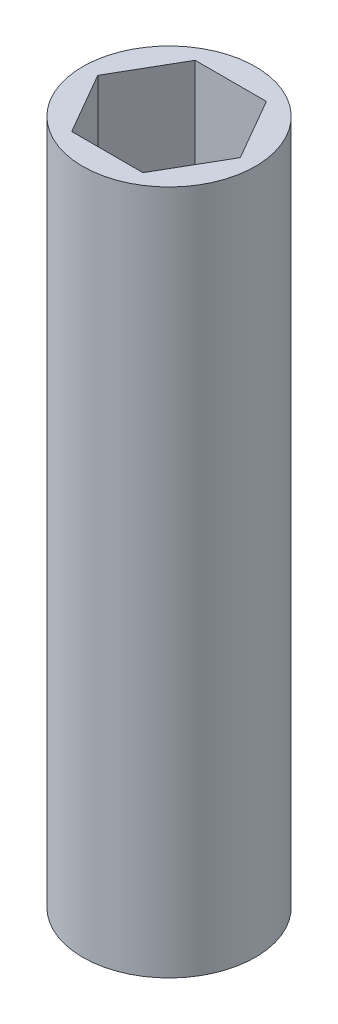
ISO-10303-21;
HEADER;
FILE_DESCRIPTION(('STEP AP214'),'2;1');
FILE_NAME('part.step','',(''),(''),'','','');
FILE_SCHEMA(('AUTOMOTIVE_DESIGN { 1 0 10303 214 1 1 1 1 }'));
ENDSEC;
DATA;
#1=APPLICATION_CONTEXT('core data for automotive mechanical design processes');
#2=APPLICATION_PROTOCOL_DEFINITION('international standard','automotive_design',2000,#1);
#3=PRODUCT_CONTEXT('',#1,'mechanical');
#4=PRODUCT('Part','Part','',(#3));
#5=PRODUCT_RELATED_PRODUCT_CATEGORY('part','',(#4));
#6=PRODUCT_DEFINITION_FORMATION('','',#4);
#7=PRODUCT_DEFINITION_CONTEXT('part definition',#1,'design');
#8=PRODUCT_DEFINITION('design','',#6,#7);
#9=PRODUCT_DEFINITION_SHAPE('','',#8);
#10=(LENGTH_UNIT() NAMED_UNIT(*) SI_UNIT(.MILLI.,.METRE.));
#11=(NAMED_UNIT(*) PLANE_ANGLE_UNIT() SI_UNIT($,.RADIAN.));
#12=(NAMED_UNIT(*) SI_UNIT($,.STERADIAN.) SOLID_ANGLE_UNIT());
#13=UNCERTAINTY_MEASURE_WITH_UNIT(LENGTH_MEASURE(1.E-05),#10,'distance_accuracy_value','');
#14=(GEOMETRIC_REPRESENTATION_CONTEXT(3) GLOBAL_UNCERTAINTY_ASSIGNED_CONTEXT((#13)) GLOBAL_UNIT_ASSIGNED_CONTEXT((#10,
#11,#12)) REPRESENTATION_CONTEXT('',''));
#15=CARTESIAN_POINT('',(0.,0.,0.));
#16=DIRECTION('',(0.,0.,1.));
#17=DIRECTION('',(1.,0.,0.));
#18=AXIS2_PLACEMENT_3D('',#15,#16,#17);
#19=CARTESIAN_POINT('',(0.,56.388,0.));
#20=DIRECTION('',(0.,1.,0.));
#21=DIRECTION('',(0.,0.,1.));
#22=AXIS2_PLACEMENT_3D('',#19,#20,#21);
#23=PLANE('',#22);
#24=CARTESIAN_POINT('',(0.,56.388,0.));
#25=DIRECTION('',(0.,1.,0.));
#26=DIRECTION('',(0.,0.,1.));
#27=AXIS2_PLACEMENT_3D('',#24,#25,#26);
#28=CIRCLE('',#27,7.112);
#29=CARTESIAN_POINT('',(0.,56.388,7.112));
#30=VERTEX_POINT('',#29);
#31=EDGE_CURVE('E11',#30,#30,#28,.T.);
#32=ORIENTED_EDGE('',*,*,#31,.T.);
#33=EDGE_LOOP('',(#32));
#34=FACE_BOUND('',#33,.T.);
#35=DIRECTION('',(0.5,0.,-0.866025403784439));
#36=VECTOR('',#35,1.);
#37=CARTESIAN_POINT('',(2.9329393674833,56.388,5.08));
#38=LINE('',#37,#36);
#39=CARTESIAN_POINT('',(2.9329393674833,56.388,5.08));
#40=VERTEX_POINT('',#39);
#41=CARTESIAN_POINT('',(5.8658787349666,56.388,0.));
#42=VERTEX_POINT('',#41);
#43=EDGE_CURVE('E103',#40,#42,#38,.T.);
#44=ORIENTED_EDGE('',*,*,#43,.F.);
#45=DIRECTION('',(1.,0.,0.));
#46=VECTOR('',#45,1.);
#47=CARTESIAN_POINT('',(-2.9329393674833,56.388,5.08));
#48=LINE('',#47,#46);
#49=CARTESIAN_POINT('',(-2.9329393674833,56.388,5.08));
#50=VERTEX_POINT('',#49);
#51=EDGE_CURVE('E95',#50,#40,#48,.T.);
#52=ORIENTED_EDGE('',*,*,#51,.F.);
#53=DIRECTION('',(0.5,0.,0.866025403784439));
#54=VECTOR('',#53,1.);
#55=CARTESIAN_POINT('',(-5.8658787349666,56.388,0.));
#56=LINE('',#55,#54);
#57=CARTESIAN_POINT('',(-5.8658787349666,56.388,0.));
#58=VERTEX_POINT('',#57);
#59=EDGE_CURVE('E123',#58,#50,#56,.T.);
#60=ORIENTED_EDGE('',*,*,#59,.F.);
#61=DIRECTION('',(-0.5,0.,0.866025403784439));
#62=VECTOR('',#61,1.);
#63=CARTESIAN_POINT('',(-2.9329393674833,56.388,-5.08));
#64=LINE('',#63,#62);
#65=CARTESIAN_POINT('',(-2.9329393674833,56.388,-5.08));
#66=VERTEX_POINT('',#65);
#67=EDGE_CURVE('E121',#66,#58,#64,.T.);
#68=ORIENTED_EDGE('',*,*,#67,.F.);
#69=DIRECTION('',(-1.,0.,0.));
#70=VECTOR('',#69,1.);
#71=CARTESIAN_POINT('',(2.9329393674833,56.388,-5.08));
#72=LINE('',#71,#70);
#73=CARTESIAN_POINT('',(2.9329393674833,56.388,-5.08));
#74=VERTEX_POINT('',#73);
#75=EDGE_CURVE('E117',#74,#66,#72,.T.);
#76=ORIENTED_EDGE('',*,*,#75,.F.);
#77=DIRECTION('',(-0.5,0.,-0.866025403784439));
#78=VECTOR('',#77,1.);
#79=CARTESIAN_POINT('',(5.8658787349666,56.388,0.));
#80=LINE('',#79,#78);
#81=EDGE_CURVE('E115',#42,#74,#80,.T.);
#82=ORIENTED_EDGE('',*,*,#81,.F.);
#83=EDGE_LOOP('',(#44,#52,#60,#68,#76,#82));
#84=FACE_BOUND('',#83,.T.);
#85=ADVANCED_FACE('F42',(#34,#84),#23,.T.);
#86=CARTESIAN_POINT('',(0.,0.,0.));
#87=DIRECTION('',(0.,1.,0.));
#88=DIRECTION('',(0.,0.,1.));
#89=AXIS2_PLACEMENT_3D('',#86,#87,#88);
#90=PLANE('',#89);
#91=CARTESIAN_POINT('',(0.,0.,0.));
#92=DIRECTION('',(0.,1.,0.));
#93=DIRECTION('',(0.,0.,1.));
#94=AXIS2_PLACEMENT_3D('',#91,#92,#93);
#95=CIRCLE('',#94,7.112);
#96=CARTESIAN_POINT('',(0.,0.,7.112));
#97=VERTEX_POINT('',#96);
#98=EDGE_CURVE('E46',#97,#97,#95,.T.);
#99=ORIENTED_EDGE('',*,*,#98,.F.);
#100=EDGE_LOOP('',(#99));
#101=FACE_BOUND('',#100,.T.);
#102=DIRECTION('',(1.,0.,0.));
#103=VECTOR('',#102,1.);
#104=CARTESIAN_POINT('',(-2.9329393674833,0.,5.08));
#105=LINE('',#104,#103);
#106=CARTESIAN_POINT('',(-2.9329393674833,0.,5.08));
#107=VERTEX_POINT('',#106);
#108=CARTESIAN_POINT('',(2.9329393674833,0.,5.08));
#109=VERTEX_POINT('',#108);
#110=EDGE_CURVE('E65',#107,#109,#105,.T.);
#111=ORIENTED_EDGE('',*,*,#110,.T.);
#112=DIRECTION('',(0.5,0.,-0.866025403784439));
#113=VECTOR('',#112,1.);
#114=CARTESIAN_POINT('',(2.9329393674833,0.,5.08));
#115=LINE('',#114,#113);
#116=CARTESIAN_POINT('',(5.8658787349666,0.,0.));
#117=VERTEX_POINT('',#116);
#118=EDGE_CURVE('E110',#109,#117,#115,.T.);
#119=ORIENTED_EDGE('',*,*,#118,.T.);
#120=DIRECTION('',(-0.5,0.,-0.866025403784439));
#121=VECTOR('',#120,1.);
#122=CARTESIAN_POINT('',(5.8658787349666,0.,0.));
#123=LINE('',#122,#121);
#124=CARTESIAN_POINT('',(2.9329393674833,0.,-5.08));
#125=VERTEX_POINT('',#124);
#126=EDGE_CURVE('E127',#117,#125,#123,.T.);
#127=ORIENTED_EDGE('',*,*,#126,.T.);
#128=DIRECTION('',(-1.,0.,0.));
#129=VECTOR('',#128,1.);
#130=CARTESIAN_POINT('',(2.9329393674833,0.,-5.08));
#131=LINE('',#130,#129);
#132=CARTESIAN_POINT('',(-2.9329393674833,0.,-5.08));
#133=VERTEX_POINT('',#132);
#134=EDGE_CURVE('E130',#125,#133,#131,.T.);
#135=ORIENTED_EDGE('',*,*,#134,.T.);
#136=DIRECTION('',(-0.5,0.,0.866025403784439));
#137=VECTOR('',#136,1.);
#138=CARTESIAN_POINT('',(-2.9329393674833,0.,-5.08));
#139=LINE('',#138,#137);
#140=CARTESIAN_POINT('',(-5.8658787349666,0.,0.));
#141=VERTEX_POINT('',#140);
#142=EDGE_CURVE('E133',#133,#141,#139,.T.);
#143=ORIENTED_EDGE('',*,*,#142,.T.);
#144=DIRECTION('',(0.5,0.,0.866025403784439));
#145=VECTOR('',#144,1.);
#146=CARTESIAN_POINT('',(-5.8658787349666,0.,0.));
#147=LINE('',#146,#145);
#148=EDGE_CURVE('E104',#141,#107,#147,.T.);
#149=ORIENTED_EDGE('',*,*,#148,.T.);
#150=EDGE_LOOP('',(#111,#119,#127,#135,#143,#149));
#151=FACE_BOUND('',#150,.T.);
#152=ADVANCED_FACE('F150',(#101,#151),#90,.F.);
#153=CARTESIAN_POINT('',(0.,56.388,0.));
#154=DIRECTION('',(0.,-1.,0.));
#155=DIRECTION('',(0.,0.,-1.));
#156=AXIS2_PLACEMENT_3D('',#153,#154,#155);
#157=CYLINDRICAL_SURFACE('',#156,7.112);
#158=ORIENTED_EDGE('',*,*,#31,.F.);
#159=EDGE_LOOP('',(#158));
#160=FACE_BOUND('',#159,.T.);
#161=ORIENTED_EDGE('',*,*,#98,.T.);
#162=EDGE_LOOP('',(#161));
#163=FACE_BOUND('',#162,.T.);
#164=ADVANCED_FACE('F44',(#160,#163),#157,.T.);
#165=CARTESIAN_POINT('',(-2.9329393674833,56.388,5.08));
#166=DIRECTION('',(0.,0.,-1.));
#167=DIRECTION('',(-1.,0.,0.));
#168=AXIS2_PLACEMENT_3D('',#165,#166,#167);
#169=PLANE('',#168);
#170=ORIENTED_EDGE('',*,*,#110,.F.);
#171=DIRECTION('',(0.,-1.,0.));
#172=VECTOR('',#171,1.);
#173=CARTESIAN_POINT('',(-2.9329393674833,56.388,5.08));
#174=LINE('',#173,#172);
#175=EDGE_CURVE('E99',#50,#107,#174,.T.);
#176=ORIENTED_EDGE('',*,*,#175,.F.);
#177=ORIENTED_EDGE('',*,*,#51,.T.);
#178=DIRECTION('',(0.,-1.,0.));
#179=VECTOR('',#178,1.);
#180=CARTESIAN_POINT('',(2.9329393674833,56.388,5.08));
#181=LINE('',#180,#179);
#182=EDGE_CURVE('E98',#40,#109,#181,.T.);
#183=ORIENTED_EDGE('',*,*,#182,.T.);
#184=EDGE_LOOP('',(#170,#176,#177,#183));
#185=FACE_BOUND('',#184,.T.);
#186=ADVANCED_FACE('F97',(#185),#169,.T.);
#187=CARTESIAN_POINT('',(2.9329393674833,56.388,5.08));
#188=DIRECTION('',(-0.866025403784439,0.,-0.5));
#189=DIRECTION('',(-0.5,0.,0.866025403784439));
#190=AXIS2_PLACEMENT_3D('',#187,#188,#189);
#191=PLANE('',#190);
#192=ORIENTED_EDGE('',*,*,#118,.F.);
#193=ORIENTED_EDGE('',*,*,#182,.F.);
#194=ORIENTED_EDGE('',*,*,#43,.T.);
#195=DIRECTION('',(0.,-1.,0.));
#196=VECTOR('',#195,1.);
#197=CARTESIAN_POINT('',(5.8658787349666,56.388,0.));
#198=LINE('',#197,#196);
#199=EDGE_CURVE('E111',#42,#117,#198,.T.);
#200=ORIENTED_EDGE('',*,*,#199,.T.);
#201=EDGE_LOOP('',(#192,#193,#194,#200));
#202=FACE_BOUND('',#201,.T.);
#203=ADVANCED_FACE('F107',(#202),#191,.T.);
#204=CARTESIAN_POINT('',(5.8658787349666,56.388,0.));
#205=DIRECTION('',(-0.866025403784439,0.,0.5));
#206=DIRECTION('',(0.5,0.,0.866025403784439));
#207=AXIS2_PLACEMENT_3D('',#204,#205,#206);
#208=PLANE('',#207);
#209=ORIENTED_EDGE('',*,*,#126,.F.);
#210=ORIENTED_EDGE('',*,*,#199,.F.);
#211=ORIENTED_EDGE('',*,*,#81,.T.);
#212=DIRECTION('',(0.,-1.,0.));
#213=VECTOR('',#212,1.);
#214=CARTESIAN_POINT('',(2.9329393674833,56.388,-5.08));
#215=LINE('',#214,#213);
#216=EDGE_CURVE('E142',#74,#125,#215,.T.);
#217=ORIENTED_EDGE('',*,*,#216,.T.);
#218=EDGE_LOOP('',(#209,#210,#211,#217));
#219=FACE_BOUND('',#218,.T.);
#220=ADVANCED_FACE('F146',(#219),#208,.T.);
#221=CARTESIAN_POINT('',(2.9329393674833,56.388,-5.08));
#222=DIRECTION('',(0.,0.,1.));
#223=DIRECTION('',(1.,0.,0.));
#224=AXIS2_PLACEMENT_3D('',#221,#222,#223);
#225=PLANE('',#224);
#226=ORIENTED_EDGE('',*,*,#134,.F.);
#227=ORIENTED_EDGE('',*,*,#216,.F.);
#228=ORIENTED_EDGE('',*,*,#75,.T.);
#229=DIRECTION('',(0.,-1.,0.));
#230=VECTOR('',#229,1.);
#231=CARTESIAN_POINT('',(-2.9329393674833,56.388,-5.08));
#232=LINE('',#231,#230);
#233=EDGE_CURVE('E140',#66,#133,#232,.T.);
#234=ORIENTED_EDGE('',*,*,#233,.T.);
#235=EDGE_LOOP('',(#226,#227,#228,#234));
#236=FACE_BOUND('',#235,.T.);
#237=ADVANCED_FACE('F158',(#236),#225,.T.);
#238=CARTESIAN_POINT('',(-2.9329393674833,56.388,-5.08));
#239=DIRECTION('',(0.866025403784439,0.,0.5));
#240=DIRECTION('',(0.5,0.,-0.866025403784439));
#241=AXIS2_PLACEMENT_3D('',#238,#239,#240);
#242=PLANE('',#241);
#243=ORIENTED_EDGE('',*,*,#142,.F.);
#244=ORIENTED_EDGE('',*,*,#233,.F.);
#245=ORIENTED_EDGE('',*,*,#67,.T.);
#246=DIRECTION('',(0.,-1.,0.));
#247=VECTOR('',#246,1.);
#248=CARTESIAN_POINT('',(-5.8658787349666,56.388,0.));
#249=LINE('',#248,#247);
#250=EDGE_CURVE('E57',#58,#141,#249,.T.);
#251=ORIENTED_EDGE('',*,*,#250,.T.);
#252=EDGE_LOOP('',(#243,#244,#245,#251));
#253=FACE_BOUND('',#252,.T.);
#254=ADVANCED_FACE('F156',(#253),#242,.T.);
#255=CARTESIAN_POINT('',(-5.8658787349666,56.388,0.));
#256=DIRECTION('',(0.866025403784439,0.,-0.5));
#257=DIRECTION('',(-0.5,0.,-0.866025403784439));
#258=AXIS2_PLACEMENT_3D('',#255,#256,#257);
#259=PLANE('',#258);
#260=ORIENTED_EDGE('',*,*,#148,.F.);
#261=ORIENTED_EDGE('',*,*,#250,.F.);
#262=ORIENTED_EDGE('',*,*,#59,.T.);
#263=ORIENTED_EDGE('',*,*,#175,.T.);
#264=EDGE_LOOP('',(#260,#261,#262,#263));
#265=FACE_BOUND('',#264,.T.);
#266=ADVANCED_FACE('F152',(#265),#259,.T.);
#267=CLOSED_SHELL('',(#85,#152,#164,#186,#203,#220,#237,#254,#266));
#268=MANIFOLD_SOLID_BREP('B2',#267);
#269=ADVANCED_BREP_SHAPE_REPRESENTATION('',(#18,#268),#14);
#270=SHAPE_DEFINITION_REPRESENTATION(#9,#269);
ENDSEC;
END-ISO-10303-21;
